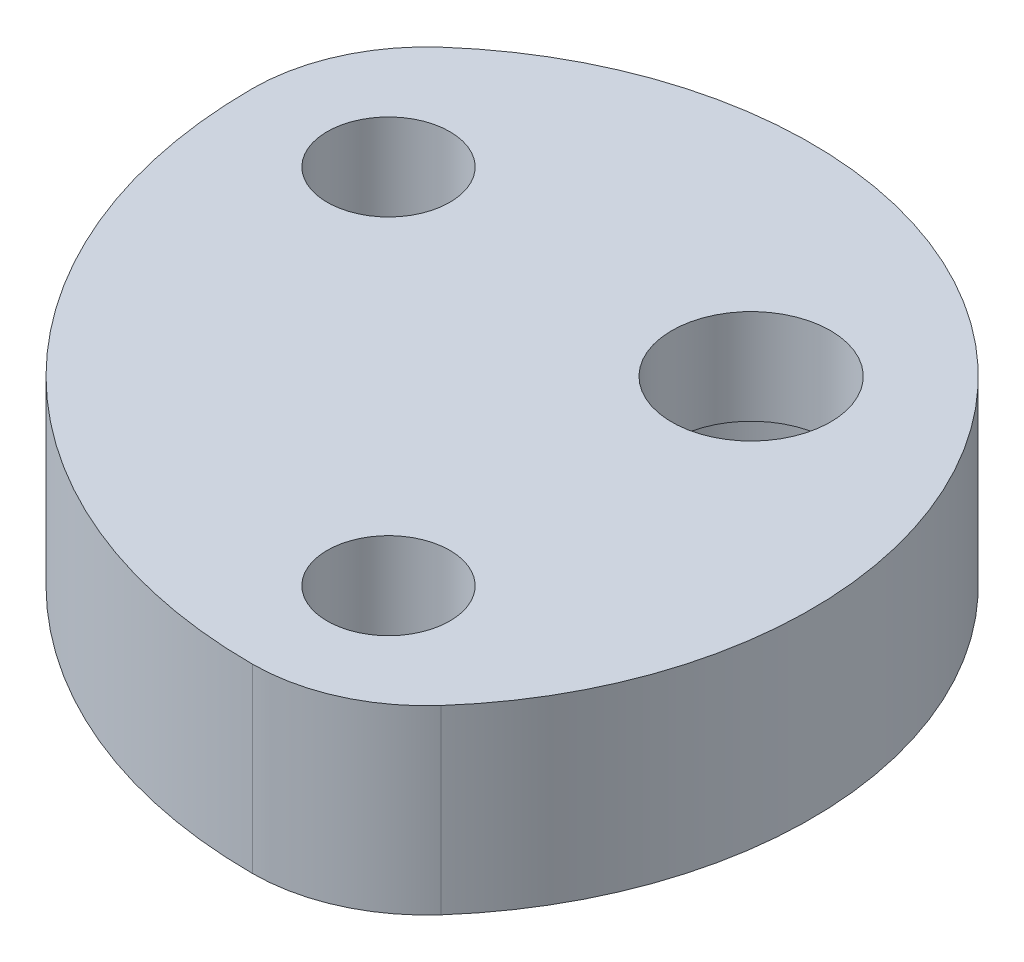
ISO-10303-21;
HEADER;
FILE_DESCRIPTION(('STEP AP214'),'2;1');
FILE_NAME('part.step','',(''),(''),'','','');
FILE_SCHEMA(('AUTOMOTIVE_DESIGN { 1 0 10303 214 1 1 1 1 }'));
ENDSEC;
DATA;
#1=APPLICATION_CONTEXT('core data for automotive mechanical design processes');
#2=APPLICATION_PROTOCOL_DEFINITION('international standard','automotive_design',2000,#1);
#3=PRODUCT_CONTEXT('',#1,'mechanical');
#4=PRODUCT('Part','Part','',(#3));
#5=PRODUCT_RELATED_PRODUCT_CATEGORY('part','',(#4));
#6=PRODUCT_DEFINITION_FORMATION('','',#4);
#7=PRODUCT_DEFINITION_CONTEXT('part definition',#1,'design');
#8=PRODUCT_DEFINITION('design','',#6,#7);
#9=PRODUCT_DEFINITION_SHAPE('','',#8);
#10=(LENGTH_UNIT() NAMED_UNIT(*) SI_UNIT(.MILLI.,.METRE.));
#11=(NAMED_UNIT(*) PLANE_ANGLE_UNIT() SI_UNIT($,.RADIAN.));
#12=(NAMED_UNIT(*) SI_UNIT($,.STERADIAN.) SOLID_ANGLE_UNIT());
#13=UNCERTAINTY_MEASURE_WITH_UNIT(LENGTH_MEASURE(1.E-05),#10,'distance_accuracy_value','');
#14=(GEOMETRIC_REPRESENTATION_CONTEXT(3) GLOBAL_UNCERTAINTY_ASSIGNED_CONTEXT((#13)) GLOBAL_UNIT_ASSIGNED_CONTEXT((#10,
#11,#12)) REPRESENTATION_CONTEXT('',''));
#15=CARTESIAN_POINT('',(0.,0.,0.));
#16=DIRECTION('',(0.,0.,1.));
#17=DIRECTION('',(1.,0.,0.));
#18=AXIS2_PLACEMENT_3D('',#15,#16,#17);
#19=CARTESIAN_POINT('',(0.,4.,0.));
#20=DIRECTION('',(0.,-1.,0.));
#21=DIRECTION('',(0.,0.,-1.));
#22=AXIS2_PLACEMENT_3D('',#19,#20,#21);
#23=CYLINDRICAL_SURFACE('',#22,11.);
#24=CARTESIAN_POINT('',(0.,0.,0.));
#25=DIRECTION('',(0.,1.,0.));
#26=DIRECTION('',(0.,0.,-1.));
#27=AXIS2_PLACEMENT_3D('',#24,#25,#26);
#28=CIRCLE('',#27,11.);
#29=CARTESIAN_POINT('',(-11.,0.,0.));
#30=VERTEX_POINT('',#29);
#31=CARTESIAN_POINT('',(0.,0.,11.));
#32=VERTEX_POINT('',#31);
#33=EDGE_CURVE('E97',#30,#32,#28,.T.);
#34=ORIENTED_EDGE('',*,*,#33,.T.);
#35=DIRECTION('',(0.,-1.,0.));
#36=VECTOR('',#35,1.);
#37=CARTESIAN_POINT('',(0.,4.,11.));
#38=LINE('',#37,#36);
#39=CARTESIAN_POINT('',(0.,4.,11.));
#40=VERTEX_POINT('',#39);
#41=EDGE_CURVE('E11',#40,#32,#38,.T.);
#42=ORIENTED_EDGE('',*,*,#41,.F.);
#43=CARTESIAN_POINT('',(0.,4.,0.));
#44=DIRECTION('',(0.,1.,0.));
#45=DIRECTION('',(0.,0.,-1.));
#46=AXIS2_PLACEMENT_3D('',#43,#44,#45);
#47=CIRCLE('',#46,11.);
#48=CARTESIAN_POINT('',(-11.,4.,0.));
#49=VERTEX_POINT('',#48);
#50=EDGE_CURVE('E84',#49,#40,#47,.T.);
#51=ORIENTED_EDGE('',*,*,#50,.F.);
#52=DIRECTION('',(0.,-1.,0.));
#53=VECTOR('',#52,1.);
#54=CARTESIAN_POINT('',(-11.,4.,0.));
#55=LINE('',#54,#53);
#56=EDGE_CURVE('E93',#49,#30,#55,.T.);
#57=ORIENTED_EDGE('',*,*,#56,.T.);
#58=EDGE_LOOP('',(#34,#42,#51,#57));
#59=FACE_BOUND('',#58,.T.);
#60=ADVANCED_FACE('F34',(#59),#23,.T.);
#61=CARTESIAN_POINT('',(0.,4.,7.16529894984449));
#62=DIRECTION('',(0.,-1.,0.));
#63=DIRECTION('',(0.,0.,-1.));
#64=AXIS2_PLACEMENT_3D('',#61,#62,#63);
#65=CYLINDRICAL_SURFACE('',#64,3.83470105015551);
#66=CARTESIAN_POINT('',(0.,0.,7.16529894984449));
#67=DIRECTION('',(0.,1.,0.));
#68=DIRECTION('',(0.,0.,-1.));
#69=AXIS2_PLACEMENT_3D('',#66,#67,#68);
#70=CIRCLE('',#69,3.83470105015551);
#71=CARTESIAN_POINT('',(2.86684835628531,0.,9.71208371619754));
#72=VERTEX_POINT('',#71);
#73=EDGE_CURVE('E89',#32,#72,#70,.T.);
#74=ORIENTED_EDGE('',*,*,#73,.T.);
#75=DIRECTION('',(0.,-1.,0.));
#76=VECTOR('',#75,1.);
#77=CARTESIAN_POINT('',(2.86684835628531,4.,9.71208371619754));
#78=LINE('',#77,#76);
#79=CARTESIAN_POINT('',(2.86684835628531,4.,9.71208371619754));
#80=VERTEX_POINT('',#79);
#81=EDGE_CURVE('E42',#80,#72,#78,.T.);
#82=ORIENTED_EDGE('',*,*,#81,.F.);
#83=CARTESIAN_POINT('',(0.,4.,7.16529894984449));
#84=DIRECTION('',(0.,1.,0.));
#85=DIRECTION('',(0.,0.,-1.));
#86=AXIS2_PLACEMENT_3D('',#83,#84,#85);
#87=CIRCLE('',#86,3.83470105015551);
#88=EDGE_CURVE('E79',#40,#80,#87,.T.);
#89=ORIENTED_EDGE('',*,*,#88,.F.);
#90=ORIENTED_EDGE('',*,*,#41,.T.);
#91=EDGE_LOOP('',(#74,#82,#89,#90));
#92=FACE_BOUND('',#91,.T.);
#93=ADVANCED_FACE('F88',(#92),#65,.T.);
#94=CARTESIAN_POINT('',(-3.79446206481083,4.,3.79446206481079));
#95=DIRECTION('',(0.,-1.,0.));
#96=DIRECTION('',(0.,0.,-1.));
#97=AXIS2_PLACEMENT_3D('',#94,#95,#96);
#98=CYLINDRICAL_SURFACE('',#97,8.91017971396567);
#99=CARTESIAN_POINT('',(-3.79446206481083,0.,3.79446206481079));
#100=DIRECTION('',(0.,1.,0.));
#101=DIRECTION('',(0.,0.,1.));
#102=AXIS2_PLACEMENT_3D('',#99,#100,#101);
#103=CIRCLE('',#102,8.91017971396567);
#104=CARTESIAN_POINT('',(-9.71208371619741,0.,-2.8668483562855));
#105=VERTEX_POINT('',#104);
#106=EDGE_CURVE('E66',#72,#105,#103,.T.);
#107=ORIENTED_EDGE('',*,*,#106,.T.);
#108=DIRECTION('',(0.,-1.,0.));
#109=VECTOR('',#108,1.);
#110=CARTESIAN_POINT('',(-9.71208371619741,4.,-2.8668483562855));
#111=LINE('',#110,#109);
#112=CARTESIAN_POINT('',(-9.71208371619741,4.,-2.8668483562855));
#113=VERTEX_POINT('',#112);
#114=EDGE_CURVE('E90',#113,#105,#111,.T.);
#115=ORIENTED_EDGE('',*,*,#114,.F.);
#116=CARTESIAN_POINT('',(-3.79446206481083,4.,3.79446206481079));
#117=DIRECTION('',(0.,1.,0.));
#118=DIRECTION('',(0.,0.,-1.));
#119=AXIS2_PLACEMENT_3D('',#116,#117,#118);
#120=CIRCLE('',#119,8.91017971396567);
#121=EDGE_CURVE('E82',#80,#113,#120,.T.);
#122=ORIENTED_EDGE('',*,*,#121,.F.);
#123=ORIENTED_EDGE('',*,*,#81,.T.);
#124=EDGE_LOOP('',(#107,#115,#122,#123));
#125=FACE_BOUND('',#124,.T.);
#126=ADVANCED_FACE('F91',(#125),#98,.T.);
#127=CARTESIAN_POINT('',(-7.16529894984433,4.,0.));
#128=DIRECTION('',(0.,-1.,0.));
#129=DIRECTION('',(0.,0.,-1.));
#130=AXIS2_PLACEMENT_3D('',#127,#128,#129);
#131=CYLINDRICAL_SURFACE('',#130,3.83470105015567);
#132=CARTESIAN_POINT('',(-7.16529894984433,0.,0.));
#133=DIRECTION('',(0.,1.,0.));
#134=DIRECTION('',(0.,0.,1.));
#135=AXIS2_PLACEMENT_3D('',#132,#133,#134);
#136=CIRCLE('',#135,3.83470105015567);
#137=EDGE_CURVE('E72',#105,#30,#136,.T.);
#138=ORIENTED_EDGE('',*,*,#137,.T.);
#139=ORIENTED_EDGE('',*,*,#56,.F.);
#140=CARTESIAN_POINT('',(-7.16529894984433,4.,0.));
#141=DIRECTION('',(0.,1.,0.));
#142=DIRECTION('',(0.,0.,1.));
#143=AXIS2_PLACEMENT_3D('',#140,#141,#142);
#144=CIRCLE('',#143,3.83470105015567);
#145=EDGE_CURVE('E50',#113,#49,#144,.T.);
#146=ORIENTED_EDGE('',*,*,#145,.F.);
#147=ORIENTED_EDGE('',*,*,#114,.T.);
#148=EDGE_LOOP('',(#138,#139,#146,#147));
#149=FACE_BOUND('',#148,.T.);
#150=ADVANCED_FACE('F105',(#149),#131,.T.);
#151=CARTESIAN_POINT('',(-3.58264947492216,4.,0.));
#152=DIRECTION('',(0.,-1.,0.));
#153=DIRECTION('',(0.,0.,-1.));
#154=AXIS2_PLACEMENT_3D('',#151,#152,#153);
#155=PLANE('',#154);
#156=CARTESIAN_POINT('',(0.,4.,0.));
#157=DIRECTION('',(0.,-1.,0.));
#158=DIRECTION('',(0.,0.,-1.));
#159=AXIS2_PLACEMENT_3D('',#156,#157,#158);
#160=CIRCLE('',#159,1.75);
#161=CARTESIAN_POINT('',(0.,4.,-1.75));
#162=VERTEX_POINT('',#161);
#163=EDGE_CURVE('E126',#162,#162,#160,.T.);
#164=ORIENTED_EDGE('',*,*,#163,.T.);
#165=EDGE_LOOP('',(#164));
#166=FACE_BOUND('',#165,.T.);
#167=CARTESIAN_POINT('',(-8.,4.,0.));
#168=DIRECTION('',(0.,-1.,0.));
#169=DIRECTION('',(0.,0.,-1.));
#170=AXIS2_PLACEMENT_3D('',#167,#168,#169);
#171=CIRCLE('',#170,1.35254999999999);
#172=CARTESIAN_POINT('',(-8.,4.,-1.35254999999999));
#173=VERTEX_POINT('',#172);
#174=EDGE_CURVE('E116',#173,#173,#171,.T.);
#175=ORIENTED_EDGE('',*,*,#174,.T.);
#176=EDGE_LOOP('',(#175));
#177=FACE_BOUND('',#176,.T.);
#178=CARTESIAN_POINT('',(0.,4.,8.));
#179=DIRECTION('',(0.,-1.,0.));
#180=DIRECTION('',(0.,0.,-1.));
#181=AXIS2_PLACEMENT_3D('',#178,#179,#180);
#182=CIRCLE('',#181,1.35254999999999);
#183=CARTESIAN_POINT('',(0.,4.,6.64745000000001));
#184=VERTEX_POINT('',#183);
#185=EDGE_CURVE('E100',#184,#184,#182,.T.);
#186=ORIENTED_EDGE('',*,*,#185,.T.);
#187=EDGE_LOOP('',(#186));
#188=FACE_BOUND('',#187,.T.);
#189=ORIENTED_EDGE('',*,*,#50,.T.);
#190=ORIENTED_EDGE('',*,*,#88,.T.);
#191=ORIENTED_EDGE('',*,*,#121,.T.);
#192=ORIENTED_EDGE('',*,*,#145,.T.);
#193=EDGE_LOOP('',(#189,#190,#191,#192));
#194=FACE_BOUND('',#193,.T.);
#195=ADVANCED_FACE('F80',(#166,#177,#188,#194),#155,.F.);
#196=CARTESIAN_POINT('',(-3.58264947492216,0.,0.));
#197=DIRECTION('',(0.,-1.,0.));
#198=DIRECTION('',(0.,0.,-1.));
#199=AXIS2_PLACEMENT_3D('',#196,#197,#198);
#200=PLANE('',#199);
#201=CARTESIAN_POINT('',(0.,0.,0.));
#202=DIRECTION('',(0.,-1.,0.));
#203=DIRECTION('',(0.,0.,-1.));
#204=AXIS2_PLACEMENT_3D('',#201,#202,#203);
#205=CIRCLE('',#204,3.044);
#206=CARTESIAN_POINT('',(0.,0.,-3.044));
#207=VERTEX_POINT('',#206);
#208=EDGE_CURVE('E123',#207,#207,#205,.T.);
#209=ORIENTED_EDGE('',*,*,#208,.F.);
#210=EDGE_LOOP('',(#209));
#211=FACE_BOUND('',#210,.T.);
#212=CARTESIAN_POINT('',(-8.,0.,0.));
#213=DIRECTION('',(0.,-1.,0.));
#214=DIRECTION('',(0.,0.,-1.));
#215=AXIS2_PLACEMENT_3D('',#212,#213,#214);
#216=CIRCLE('',#215,1.35254999999999);
#217=CARTESIAN_POINT('',(-8.,0.,-1.35254999999999));
#218=VERTEX_POINT('',#217);
#219=EDGE_CURVE('E119',#218,#218,#216,.T.);
#220=ORIENTED_EDGE('',*,*,#219,.F.);
#221=EDGE_LOOP('',(#220));
#222=FACE_BOUND('',#221,.T.);
#223=CARTESIAN_POINT('',(0.,0.,8.));
#224=DIRECTION('',(0.,-1.,0.));
#225=DIRECTION('',(0.,0.,-1.));
#226=AXIS2_PLACEMENT_3D('',#223,#224,#225);
#227=CIRCLE('',#226,1.35254999999999);
#228=CARTESIAN_POINT('',(0.,0.,6.64745000000001));
#229=VERTEX_POINT('',#228);
#230=EDGE_CURVE('E113',#229,#229,#227,.T.);
#231=ORIENTED_EDGE('',*,*,#230,.F.);
#232=EDGE_LOOP('',(#231));
#233=FACE_BOUND('',#232,.T.);
#234=ORIENTED_EDGE('',*,*,#33,.F.);
#235=ORIENTED_EDGE('',*,*,#137,.F.);
#236=ORIENTED_EDGE('',*,*,#106,.F.);
#237=ORIENTED_EDGE('',*,*,#73,.F.);
#238=EDGE_LOOP('',(#234,#235,#236,#237));
#239=FACE_BOUND('',#238,.T.);
#240=ADVANCED_FACE('F108',(#211,#222,#233,#239),#200,.T.);
#241=CARTESIAN_POINT('',(0.,0.,8.));
#242=DIRECTION('',(0.,-1.,0.));
#243=DIRECTION('',(0.,0.,-1.));
#244=AXIS2_PLACEMENT_3D('',#241,#242,#243);
#245=CYLINDRICAL_SURFACE('',#244,1.35254999999999);
#246=ORIENTED_EDGE('',*,*,#185,.F.);
#247=EDGE_LOOP('',(#246));
#248=FACE_BOUND('',#247,.T.);
#249=ORIENTED_EDGE('',*,*,#230,.T.);
#250=EDGE_LOOP('',(#249));
#251=FACE_BOUND('',#250,.T.);
#252=ADVANCED_FACE('F158',(#248,#251),#245,.F.);
#253=CARTESIAN_POINT('',(-8.,0.,0.));
#254=DIRECTION('',(0.,-1.,0.));
#255=DIRECTION('',(0.,0.,-1.));
#256=AXIS2_PLACEMENT_3D('',#253,#254,#255);
#257=CYLINDRICAL_SURFACE('',#256,1.35254999999999);
#258=ORIENTED_EDGE('',*,*,#174,.F.);
#259=EDGE_LOOP('',(#258));
#260=FACE_BOUND('',#259,.T.);
#261=ORIENTED_EDGE('',*,*,#219,.T.);
#262=EDGE_LOOP('',(#261));
#263=FACE_BOUND('',#262,.T.);
#264=ADVANCED_FACE('F152',(#260,#263),#257,.F.);
#265=CARTESIAN_POINT('',(0.,1.905,0.));
#266=DIRECTION('',(0.,-1.,0.));
#267=DIRECTION('',(0.,0.,-1.));
#268=AXIS2_PLACEMENT_3D('',#265,#266,#267);
#269=CYLINDRICAL_SURFACE('',#268,3.044);
#270=CARTESIAN_POINT('',(0.,1.905,0.));
#271=DIRECTION('',(0.,-1.,0.));
#272=DIRECTION('',(0.,0.,-1.));
#273=AXIS2_PLACEMENT_3D('',#270,#271,#272);
#274=CIRCLE('',#273,3.044);
#275=CARTESIAN_POINT('',(0.,1.905,-3.044));
#276=VERTEX_POINT('',#275);
#277=EDGE_CURVE('E122',#276,#276,#274,.T.);
#278=ORIENTED_EDGE('',*,*,#277,.F.);
#279=EDGE_LOOP('',(#278));
#280=FACE_BOUND('',#279,.T.);
#281=ORIENTED_EDGE('',*,*,#208,.T.);
#282=EDGE_LOOP('',(#281));
#283=FACE_BOUND('',#282,.T.);
#284=ADVANCED_FACE('F146',(#280,#283),#269,.F.);
#285=CARTESIAN_POINT('',(0.,1.905,0.));
#286=DIRECTION('',(0.,-1.,0.));
#287=DIRECTION('',(0.,0.,-1.));
#288=AXIS2_PLACEMENT_3D('',#285,#286,#287);
#289=PLANE('',#288);
#290=CARTESIAN_POINT('',(0.,1.905,0.));
#291=DIRECTION('',(0.,-1.,0.));
#292=DIRECTION('',(0.,0.,-1.));
#293=AXIS2_PLACEMENT_3D('',#290,#291,#292);
#294=CIRCLE('',#293,1.75);
#295=CARTESIAN_POINT('',(0.,1.905,-1.75));
#296=VERTEX_POINT('',#295);
#297=EDGE_CURVE('E129',#296,#296,#294,.T.);
#298=ORIENTED_EDGE('',*,*,#297,.F.);
#299=EDGE_LOOP('',(#298));
#300=FACE_BOUND('',#299,.T.);
#301=ORIENTED_EDGE('',*,*,#277,.T.);
#302=EDGE_LOOP('',(#301));
#303=FACE_BOUND('',#302,.T.);
#304=ADVANCED_FACE('F140',(#300,#303),#289,.T.);
#305=CARTESIAN_POINT('',(0.,4.,0.));
#306=DIRECTION('',(0.,-1.,0.));
#307=DIRECTION('',(0.,0.,-1.));
#308=AXIS2_PLACEMENT_3D('',#305,#306,#307);
#309=CYLINDRICAL_SURFACE('',#308,1.75);
#310=ORIENTED_EDGE('',*,*,#163,.F.);
#311=EDGE_LOOP('',(#310));
#312=FACE_BOUND('',#311,.T.);
#313=ORIENTED_EDGE('',*,*,#297,.T.);
#314=EDGE_LOOP('',(#313));
#315=FACE_BOUND('',#314,.T.);
#316=ADVANCED_FACE('F137',(#312,#315),#309,.F.);
#317=CLOSED_SHELL('',(#60,#93,#126,#150,#195,#240,#252,#264,#284,#304,#316));
#318=MANIFOLD_SOLID_BREP('B2',#317);
#319=ADVANCED_BREP_SHAPE_REPRESENTATION('',(#18,#318),#14);
#320=SHAPE_DEFINITION_REPRESENTATION(#9,#319);
ENDSEC;
END-ISO-10303-21;
